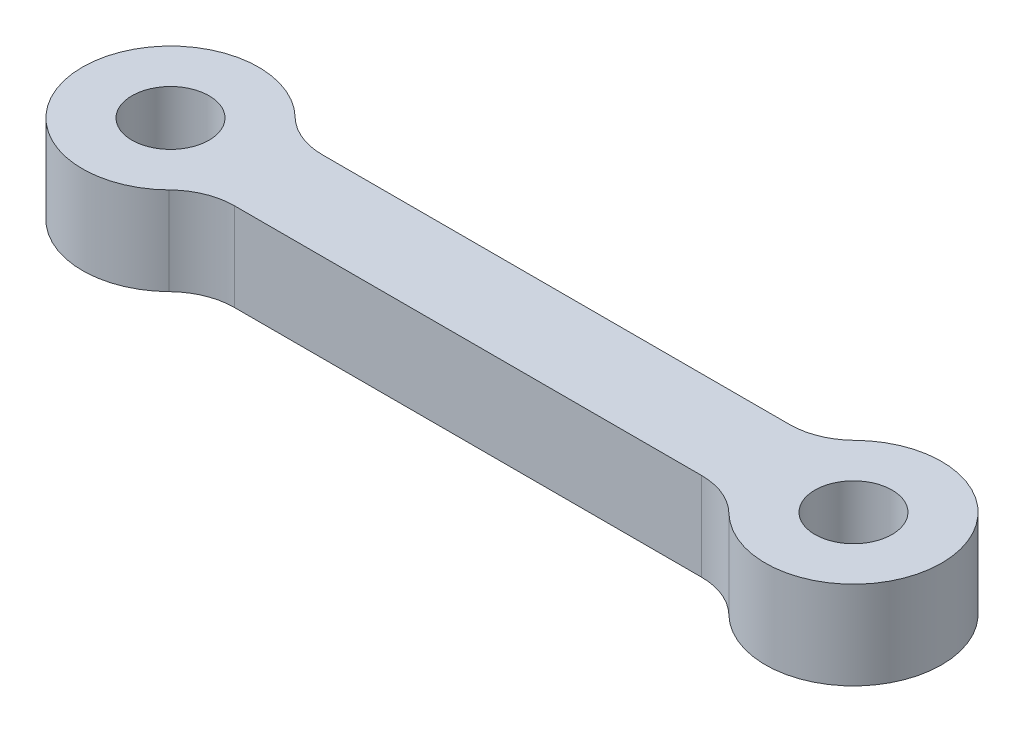
ISO-10303-21;
HEADER;
FILE_DESCRIPTION(('STEP AP214'),'2;1');
FILE_NAME('part.step','',(''),(''),'','','');
FILE_SCHEMA(('AUTOMOTIVE_DESIGN { 1 0 10303 214 1 1 1 1 }'));
ENDSEC;
DATA;
#1=APPLICATION_CONTEXT('core data for automotive mechanical design processes');
#2=APPLICATION_PROTOCOL_DEFINITION('international standard','automotive_design',2000,#1);
#3=PRODUCT_CONTEXT('',#1,'mechanical');
#4=PRODUCT('Part','Part','',(#3));
#5=PRODUCT_RELATED_PRODUCT_CATEGORY('part','',(#4));
#6=PRODUCT_DEFINITION_FORMATION('','',#4);
#7=PRODUCT_DEFINITION_CONTEXT('part definition',#1,'design');
#8=PRODUCT_DEFINITION('design','',#6,#7);
#9=PRODUCT_DEFINITION_SHAPE('','',#8);
#10=(LENGTH_UNIT() NAMED_UNIT(*) SI_UNIT(.MILLI.,.METRE.));
#11=(NAMED_UNIT(*) PLANE_ANGLE_UNIT() SI_UNIT($,.RADIAN.));
#12=(NAMED_UNIT(*) SI_UNIT($,.STERADIAN.) SOLID_ANGLE_UNIT());
#13=UNCERTAINTY_MEASURE_WITH_UNIT(LENGTH_MEASURE(1.E-05),#10,'distance_accuracy_value','');
#14=(GEOMETRIC_REPRESENTATION_CONTEXT(3) GLOBAL_UNCERTAINTY_ASSIGNED_CONTEXT((#13)) GLOBAL_UNIT_ASSIGNED_CONTEXT((#10,
#11,#12)) REPRESENTATION_CONTEXT('',''));
#15=CARTESIAN_POINT('',(0.,0.,0.));
#16=DIRECTION('',(0.,0.,1.));
#17=DIRECTION('',(1.,0.,0.));
#18=AXIS2_PLACEMENT_3D('',#15,#16,#17);
#19=CARTESIAN_POINT('',(31.,4.,0.));
#20=DIRECTION('',(0.,-1.,0.));
#21=DIRECTION('',(0.,0.,-1.));
#22=AXIS2_PLACEMENT_3D('',#19,#20,#21);
#23=CYLINDRICAL_SURFACE('',#22,4.);
#24=CARTESIAN_POINT('',(31.,4.,0.));
#25=DIRECTION('',(0.,1.,0.));
#26=DIRECTION('',(0.,0.,1.));
#27=AXIS2_PLACEMENT_3D('',#24,#25,#26);
#28=CIRCLE('',#27,4.);
#29=CARTESIAN_POINT('',(28.2005831511049,4.,2.85714285714286));
#30=VERTEX_POINT('',#29);
#31=CARTESIAN_POINT('',(28.2005831511049,4.,-2.85714285714286));
#32=VERTEX_POINT('',#31);
#33=EDGE_CURVE('E126',#30,#32,#28,.T.);
#34=ORIENTED_EDGE('',*,*,#33,.F.);
#35=DIRECTION('',(0.,-1.,0.));
#36=VECTOR('',#35,1.);
#37=CARTESIAN_POINT('',(28.2005831511049,4.,2.85714285714286));
#38=LINE('',#37,#36);
#39=CARTESIAN_POINT('',(28.2005831511049,0.,2.85714285714286));
#40=VERTEX_POINT('',#39);
#41=EDGE_CURVE('E113',#30,#40,#38,.T.);
#42=ORIENTED_EDGE('',*,*,#41,.T.);
#43=CARTESIAN_POINT('',(31.,0.,0.));
#44=DIRECTION('',(0.,1.,0.));
#45=DIRECTION('',(0.,0.,1.));
#46=AXIS2_PLACEMENT_3D('',#43,#44,#45);
#47=CIRCLE('',#46,4.);
#48=CARTESIAN_POINT('',(28.2005831511049,0.,-2.85714285714286));
#49=VERTEX_POINT('',#48);
#50=EDGE_CURVE('E124',#40,#49,#47,.T.);
#51=ORIENTED_EDGE('',*,*,#50,.T.);
#52=DIRECTION('',(0.,-1.,0.));
#53=VECTOR('',#52,1.);
#54=CARTESIAN_POINT('',(28.2005831511049,4.,-2.85714285714286));
#55=LINE('',#54,#53);
#56=EDGE_CURVE('E128',#49,#32,#55,.F.);
#57=ORIENTED_EDGE('',*,*,#56,.T.);
#58=EDGE_LOOP('',(#34,#42,#51,#57));
#59=FACE_BOUND('',#58,.T.);
#60=ADVANCED_FACE('F43',(#59),#23,.T.);
#61=CARTESIAN_POINT('',(0.,4.,-2.));
#62=DIRECTION('',(0.,0.,-1.));
#63=DIRECTION('',(-1.,0.,0.));
#64=AXIS2_PLACEMENT_3D('',#61,#62,#63);
#65=PLANE('',#64);
#66=DIRECTION('',(1.,0.,0.));
#67=VECTOR('',#66,1.);
#68=CARTESIAN_POINT('',(0.,0.,-2.));
#69=LINE('',#68,#67);
#70=CARTESIAN_POINT('',(4.89897948556636,0.,-2.));
#71=VERTEX_POINT('',#70);
#72=CARTESIAN_POINT('',(26.1010205144336,0.,-2.));
#73=VERTEX_POINT('',#72);
#74=EDGE_CURVE('E134',#71,#73,#69,.T.);
#75=ORIENTED_EDGE('',*,*,#74,.F.);
#76=DIRECTION('',(0.,-1.,0.));
#77=VECTOR('',#76,1.);
#78=CARTESIAN_POINT('',(4.89897948556636,4.,-2.));
#79=LINE('',#78,#77);
#80=CARTESIAN_POINT('',(4.89897948556636,4.,-2.));
#81=VERTEX_POINT('',#80);
#82=EDGE_CURVE('E65',#71,#81,#79,.F.);
#83=ORIENTED_EDGE('',*,*,#82,.T.);
#84=DIRECTION('',(1.,0.,0.));
#85=VECTOR('',#84,1.);
#86=CARTESIAN_POINT('',(0.,4.,-2.));
#87=LINE('',#86,#85);
#88=CARTESIAN_POINT('',(26.1010205144336,4.,-2.));
#89=VERTEX_POINT('',#88);
#90=EDGE_CURVE('E192',#81,#89,#87,.T.);
#91=ORIENTED_EDGE('',*,*,#90,.T.);
#92=DIRECTION('',(0.,-1.,0.));
#93=VECTOR('',#92,1.);
#94=CARTESIAN_POINT('',(26.1010205144336,4.,-2.));
#95=LINE('',#94,#93);
#96=EDGE_CURVE('E161',#89,#73,#95,.T.);
#97=ORIENTED_EDGE('',*,*,#96,.T.);
#98=EDGE_LOOP('',(#75,#83,#91,#97));
#99=FACE_BOUND('',#98,.T.);
#100=ADVANCED_FACE('F199',(#99),#65,.T.);
#101=CARTESIAN_POINT('',(0.,4.,0.));
#102=DIRECTION('',(0.,-1.,0.));
#103=DIRECTION('',(0.,0.,-1.));
#104=AXIS2_PLACEMENT_3D('',#101,#102,#103);
#105=CYLINDRICAL_SURFACE('',#104,4.);
#106=CARTESIAN_POINT('',(0.,4.,0.));
#107=DIRECTION('',(0.,1.,0.));
#108=DIRECTION('',(0.,0.,1.));
#109=AXIS2_PLACEMENT_3D('',#106,#107,#108);
#110=CIRCLE('',#109,4.);
#111=CARTESIAN_POINT('',(2.79941684889506,4.,-2.85714285714286));
#112=VERTEX_POINT('',#111);
#113=CARTESIAN_POINT('',(2.79941684889506,4.,2.85714285714286));
#114=VERTEX_POINT('',#113);
#115=EDGE_CURVE('E186',#112,#114,#110,.T.);
#116=ORIENTED_EDGE('',*,*,#115,.F.);
#117=DIRECTION('',(0.,-1.,0.));
#118=VECTOR('',#117,1.);
#119=CARTESIAN_POINT('',(2.79941684889506,4.,-2.85714285714286));
#120=LINE('',#119,#118);
#121=CARTESIAN_POINT('',(2.79941684889506,0.,-2.85714285714286));
#122=VERTEX_POINT('',#121);
#123=EDGE_CURVE('E158',#112,#122,#120,.T.);
#124=ORIENTED_EDGE('',*,*,#123,.T.);
#125=CARTESIAN_POINT('',(0.,0.,0.));
#126=DIRECTION('',(0.,1.,0.));
#127=DIRECTION('',(0.,0.,1.));
#128=AXIS2_PLACEMENT_3D('',#125,#126,#127);
#129=CIRCLE('',#128,4.);
#130=CARTESIAN_POINT('',(2.79941684889506,0.,2.85714285714286));
#131=VERTEX_POINT('',#130);
#132=EDGE_CURVE('E136',#122,#131,#129,.T.);
#133=ORIENTED_EDGE('',*,*,#132,.T.);
#134=DIRECTION('',(0.,-1.,0.));
#135=VECTOR('',#134,1.);
#136=CARTESIAN_POINT('',(2.79941684889506,4.,2.85714285714286));
#137=LINE('',#136,#135);
#138=EDGE_CURVE('E156',#131,#114,#137,.F.);
#139=ORIENTED_EDGE('',*,*,#138,.T.);
#140=EDGE_LOOP('',(#116,#124,#133,#139));
#141=FACE_BOUND('',#140,.T.);
#142=ADVANCED_FACE('F177',(#141),#105,.T.);
#143=CARTESIAN_POINT('',(0.,4.,0.));
#144=DIRECTION('',(0.,-1.,0.));
#145=DIRECTION('',(0.,0.,-1.));
#146=AXIS2_PLACEMENT_3D('',#143,#144,#145);
#147=CYLINDRICAL_SURFACE('',#146,1.75);
#148=CARTESIAN_POINT('',(0.,4.,0.));
#149=DIRECTION('',(0.,1.,0.));
#150=DIRECTION('',(0.,0.,1.));
#151=AXIS2_PLACEMENT_3D('',#148,#149,#150);
#152=CIRCLE('',#151,1.75);
#153=CARTESIAN_POINT('',(0.,4.,1.75));
#154=VERTEX_POINT('',#153);
#155=EDGE_CURVE('E189',#154,#154,#152,.T.);
#156=ORIENTED_EDGE('',*,*,#155,.T.);
#157=EDGE_LOOP('',(#156));
#158=FACE_BOUND('',#157,.T.);
#159=CARTESIAN_POINT('',(0.,0.,0.));
#160=DIRECTION('',(0.,1.,0.));
#161=DIRECTION('',(0.,0.,1.));
#162=AXIS2_PLACEMENT_3D('',#159,#160,#161);
#163=CIRCLE('',#162,1.75);
#164=CARTESIAN_POINT('',(0.,0.,1.75));
#165=VERTEX_POINT('',#164);
#166=EDGE_CURVE('E146',#165,#165,#163,.T.);
#167=ORIENTED_EDGE('',*,*,#166,.F.);
#168=EDGE_LOOP('',(#167));
#169=FACE_BOUND('',#168,.T.);
#170=ADVANCED_FACE('F220',(#158,#169),#147,.F.);
#171=CARTESIAN_POINT('',(0.,4.,2.));
#172=DIRECTION('',(0.,0.,-1.));
#173=DIRECTION('',(-1.,0.,0.));
#174=AXIS2_PLACEMENT_3D('',#171,#172,#173);
#175=PLANE('',#174);
#176=DIRECTION('',(1.,0.,0.));
#177=VECTOR('',#176,1.);
#178=CARTESIAN_POINT('',(0.,0.,2.));
#179=LINE('',#178,#177);
#180=CARTESIAN_POINT('',(4.89897948556636,0.,2.));
#181=VERTEX_POINT('',#180);
#182=CARTESIAN_POINT('',(26.1010205144336,0.,2.));
#183=VERTEX_POINT('',#182);
#184=EDGE_CURVE('E144',#181,#183,#179,.T.);
#185=ORIENTED_EDGE('',*,*,#184,.T.);
#186=DIRECTION('',(0.,1.,0.));
#187=VECTOR('',#186,1.);
#188=CARTESIAN_POINT('',(26.1010205144336,4.,2.));
#189=LINE('',#188,#187);
#190=CARTESIAN_POINT('',(26.1010205144336,4.,2.));
#191=VERTEX_POINT('',#190);
#192=EDGE_CURVE('E114',#183,#191,#189,.T.);
#193=ORIENTED_EDGE('',*,*,#192,.T.);
#194=DIRECTION('',(1.,0.,0.));
#195=VECTOR('',#194,1.);
#196=CARTESIAN_POINT('',(0.,4.,2.));
#197=LINE('',#196,#195);
#198=CARTESIAN_POINT('',(4.89897948556636,4.,2.));
#199=VERTEX_POINT('',#198);
#200=EDGE_CURVE('E185',#199,#191,#197,.T.);
#201=ORIENTED_EDGE('',*,*,#200,.F.);
#202=DIRECTION('',(0.,1.,0.));
#203=VECTOR('',#202,1.);
#204=CARTESIAN_POINT('',(4.89897948556636,0.,2.));
#205=LINE('',#204,#203);
#206=EDGE_CURVE('E127',#199,#181,#205,.F.);
#207=ORIENTED_EDGE('',*,*,#206,.T.);
#208=EDGE_LOOP('',(#185,#193,#201,#207));
#209=FACE_BOUND('',#208,.T.);
#210=ADVANCED_FACE('F188',(#209),#175,.F.);
#211=CARTESIAN_POINT('',(31.,4.,0.));
#212=DIRECTION('',(0.,-1.,0.));
#213=DIRECTION('',(0.,0.,-1.));
#214=AXIS2_PLACEMENT_3D('',#211,#212,#213);
#215=CYLINDRICAL_SURFACE('',#214,1.75);
#216=CARTESIAN_POINT('',(31.,4.,0.));
#217=DIRECTION('',(0.,1.,0.));
#218=DIRECTION('',(0.,0.,1.));
#219=AXIS2_PLACEMENT_3D('',#216,#217,#218);
#220=CIRCLE('',#219,1.75);
#221=CARTESIAN_POINT('',(31.,4.,1.75));
#222=VERTEX_POINT('',#221);
#223=EDGE_CURVE('E139',#222,#222,#220,.T.);
#224=ORIENTED_EDGE('',*,*,#223,.T.);
#225=EDGE_LOOP('',(#224));
#226=FACE_BOUND('',#225,.T.);
#227=CARTESIAN_POINT('',(31.,0.,0.));
#228=DIRECTION('',(0.,1.,0.));
#229=DIRECTION('',(0.,0.,1.));
#230=AXIS2_PLACEMENT_3D('',#227,#228,#229);
#231=CIRCLE('',#230,1.75);
#232=CARTESIAN_POINT('',(31.,0.,1.75));
#233=VERTEX_POINT('',#232);
#234=EDGE_CURVE('E149',#233,#233,#231,.T.);
#235=ORIENTED_EDGE('',*,*,#234,.F.);
#236=EDGE_LOOP('',(#235));
#237=FACE_BOUND('',#236,.T.);
#238=ADVANCED_FACE('F223',(#226,#237),#215,.F.);
#239=CARTESIAN_POINT('',(0.,4.,0.));
#240=DIRECTION('',(0.,1.,0.));
#241=DIRECTION('',(0.,0.,1.));
#242=AXIS2_PLACEMENT_3D('',#239,#240,#241);
#243=PLANE('',#242);
#244=ORIENTED_EDGE('',*,*,#200,.T.);
#245=CARTESIAN_POINT('',(26.1010205144336,4.,5.));
#246=DIRECTION('',(0.,1.,0.));
#247=DIRECTION('',(0.,0.,1.));
#248=AXIS2_PLACEMENT_3D('',#245,#246,#247);
#249=CIRCLE('',#248,3.);
#250=EDGE_CURVE('E119',#191,#30,#249,.F.);
#251=ORIENTED_EDGE('',*,*,#250,.T.);
#252=ORIENTED_EDGE('',*,*,#33,.T.);
#253=CARTESIAN_POINT('',(26.1010205144336,4.,-5.));
#254=DIRECTION('',(0.,1.,0.));
#255=DIRECTION('',(0.,0.,1.));
#256=AXIS2_PLACEMENT_3D('',#253,#254,#255);
#257=CIRCLE('',#256,3.);
#258=EDGE_CURVE('E58',#32,#89,#257,.F.);
#259=ORIENTED_EDGE('',*,*,#258,.T.);
#260=ORIENTED_EDGE('',*,*,#90,.F.);
#261=CARTESIAN_POINT('',(4.89897948556636,4.,-5.));
#262=DIRECTION('',(0.,1.,0.));
#263=DIRECTION('',(0.,0.,1.));
#264=AXIS2_PLACEMENT_3D('',#261,#262,#263);
#265=CIRCLE('',#264,3.);
#266=EDGE_CURVE('E168',#81,#112,#265,.F.);
#267=ORIENTED_EDGE('',*,*,#266,.T.);
#268=ORIENTED_EDGE('',*,*,#115,.T.);
#269=CARTESIAN_POINT('',(4.89897948556636,4.,5.));
#270=DIRECTION('',(0.,1.,0.));
#271=DIRECTION('',(0.,0.,1.));
#272=AXIS2_PLACEMENT_3D('',#269,#270,#271);
#273=CIRCLE('',#272,3.);
#274=EDGE_CURVE('E11',#114,#199,#273,.F.);
#275=ORIENTED_EDGE('',*,*,#274,.T.);
#276=EDGE_LOOP('',(#244,#251,#252,#259,#260,#267,#268,#275));
#277=FACE_BOUND('',#276,.T.);
#278=ORIENTED_EDGE('',*,*,#155,.F.);
#279=EDGE_LOOP('',(#278));
#280=FACE_BOUND('',#279,.T.);
#281=ORIENTED_EDGE('',*,*,#223,.F.);
#282=EDGE_LOOP('',(#281));
#283=FACE_BOUND('',#282,.T.);
#284=ADVANCED_FACE('F183',(#277,#280,#283),#243,.T.);
#285=CARTESIAN_POINT('',(0.,0.,0.));
#286=DIRECTION('',(0.,1.,0.));
#287=DIRECTION('',(0.,0.,1.));
#288=AXIS2_PLACEMENT_3D('',#285,#286,#287);
#289=PLANE('',#288);
#290=ORIENTED_EDGE('',*,*,#50,.F.);
#291=CARTESIAN_POINT('',(26.1010205144336,0.,5.));
#292=DIRECTION('',(0.,1.,0.));
#293=DIRECTION('',(0.,0.,1.));
#294=AXIS2_PLACEMENT_3D('',#291,#292,#293);
#295=CIRCLE('',#294,3.);
#296=EDGE_CURVE('E109',#40,#183,#295,.T.);
#297=ORIENTED_EDGE('',*,*,#296,.T.);
#298=ORIENTED_EDGE('',*,*,#184,.F.);
#299=CARTESIAN_POINT('',(4.89897948556636,0.,5.));
#300=DIRECTION('',(0.,1.,0.));
#301=DIRECTION('',(0.,0.,1.));
#302=AXIS2_PLACEMENT_3D('',#299,#300,#301);
#303=CIRCLE('',#302,3.);
#304=EDGE_CURVE('E51',#181,#131,#303,.T.);
#305=ORIENTED_EDGE('',*,*,#304,.T.);
#306=ORIENTED_EDGE('',*,*,#132,.F.);
#307=CARTESIAN_POINT('',(4.89897948556636,0.,-5.));
#308=DIRECTION('',(0.,1.,0.));
#309=DIRECTION('',(0.,0.,1.));
#310=AXIS2_PLACEMENT_3D('',#307,#308,#309);
#311=CIRCLE('',#310,3.);
#312=EDGE_CURVE('E166',#122,#71,#311,.T.);
#313=ORIENTED_EDGE('',*,*,#312,.T.);
#314=ORIENTED_EDGE('',*,*,#74,.T.);
#315=CARTESIAN_POINT('',(26.1010205144336,0.,-5.));
#316=DIRECTION('',(0.,1.,0.));
#317=DIRECTION('',(0.,0.,1.));
#318=AXIS2_PLACEMENT_3D('',#315,#316,#317);
#319=CIRCLE('',#318,3.);
#320=EDGE_CURVE('E133',#73,#49,#319,.T.);
#321=ORIENTED_EDGE('',*,*,#320,.T.);
#322=EDGE_LOOP('',(#290,#297,#298,#305,#306,#313,#314,#321));
#323=FACE_BOUND('',#322,.T.);
#324=ORIENTED_EDGE('',*,*,#166,.T.);
#325=EDGE_LOOP('',(#324));
#326=FACE_BOUND('',#325,.T.);
#327=ORIENTED_EDGE('',*,*,#234,.T.);
#328=EDGE_LOOP('',(#327));
#329=FACE_BOUND('',#328,.T.);
#330=ADVANCED_FACE('F130',(#323,#326,#329),#289,.F.);
#331=CARTESIAN_POINT('',(26.1010205144336,4.,5.));
#332=DIRECTION('',(0.,-1.,0.));
#333=DIRECTION('',(0.,0.,-1.));
#334=AXIS2_PLACEMENT_3D('',#331,#332,#333);
#335=CYLINDRICAL_SURFACE('',#334,3.);
#336=ORIENTED_EDGE('',*,*,#250,.F.);
#337=ORIENTED_EDGE('',*,*,#192,.F.);
#338=ORIENTED_EDGE('',*,*,#296,.F.);
#339=ORIENTED_EDGE('',*,*,#41,.F.);
#340=EDGE_LOOP('',(#336,#337,#338,#339));
#341=FACE_BOUND('',#340,.T.);
#342=ADVANCED_FACE('F112',(#341),#335,.F.);
#343=CARTESIAN_POINT('',(4.89897948556636,4.,-5.));
#344=DIRECTION('',(0.,-1.,0.));
#345=DIRECTION('',(0.,0.,-1.));
#346=AXIS2_PLACEMENT_3D('',#343,#344,#345);
#347=CYLINDRICAL_SURFACE('',#346,3.);
#348=ORIENTED_EDGE('',*,*,#266,.F.);
#349=ORIENTED_EDGE('',*,*,#82,.F.);
#350=ORIENTED_EDGE('',*,*,#312,.F.);
#351=ORIENTED_EDGE('',*,*,#123,.F.);
#352=EDGE_LOOP('',(#348,#349,#350,#351));
#353=FACE_BOUND('',#352,.T.);
#354=ADVANCED_FACE('F202',(#353),#347,.F.);
#355=CARTESIAN_POINT('',(26.1010205144336,4.,-5.));
#356=DIRECTION('',(0.,-1.,0.));
#357=DIRECTION('',(0.,0.,-1.));
#358=AXIS2_PLACEMENT_3D('',#355,#356,#357);
#359=CYLINDRICAL_SURFACE('',#358,3.);
#360=ORIENTED_EDGE('',*,*,#258,.F.);
#361=ORIENTED_EDGE('',*,*,#56,.F.);
#362=ORIENTED_EDGE('',*,*,#320,.F.);
#363=ORIENTED_EDGE('',*,*,#96,.F.);
#364=EDGE_LOOP('',(#360,#361,#362,#363));
#365=FACE_BOUND('',#364,.T.);
#366=ADVANCED_FACE('F198',(#365),#359,.F.);
#367=CARTESIAN_POINT('',(4.89897948556636,4.,5.));
#368=DIRECTION('',(0.,-1.,0.));
#369=DIRECTION('',(0.,0.,-1.));
#370=AXIS2_PLACEMENT_3D('',#367,#368,#369);
#371=CYLINDRICAL_SURFACE('',#370,3.);
#372=ORIENTED_EDGE('',*,*,#274,.F.);
#373=ORIENTED_EDGE('',*,*,#138,.F.);
#374=ORIENTED_EDGE('',*,*,#304,.F.);
#375=ORIENTED_EDGE('',*,*,#206,.F.);
#376=EDGE_LOOP('',(#372,#373,#374,#375));
#377=FACE_BOUND('',#376,.T.);
#378=ADVANCED_FACE('F45',(#377),#371,.F.);
#379=CLOSED_SHELL('',(#60,#100,#142,#170,#210,#238,#284,#330,#342,#354,#366,#378));
#380=MANIFOLD_SOLID_BREP('B2',#379);
#381=ADVANCED_BREP_SHAPE_REPRESENTATION('',(#18,#380),#14);
#382=SHAPE_DEFINITION_REPRESENTATION(#9,#381);
ENDSEC;
END-ISO-10303-21;
